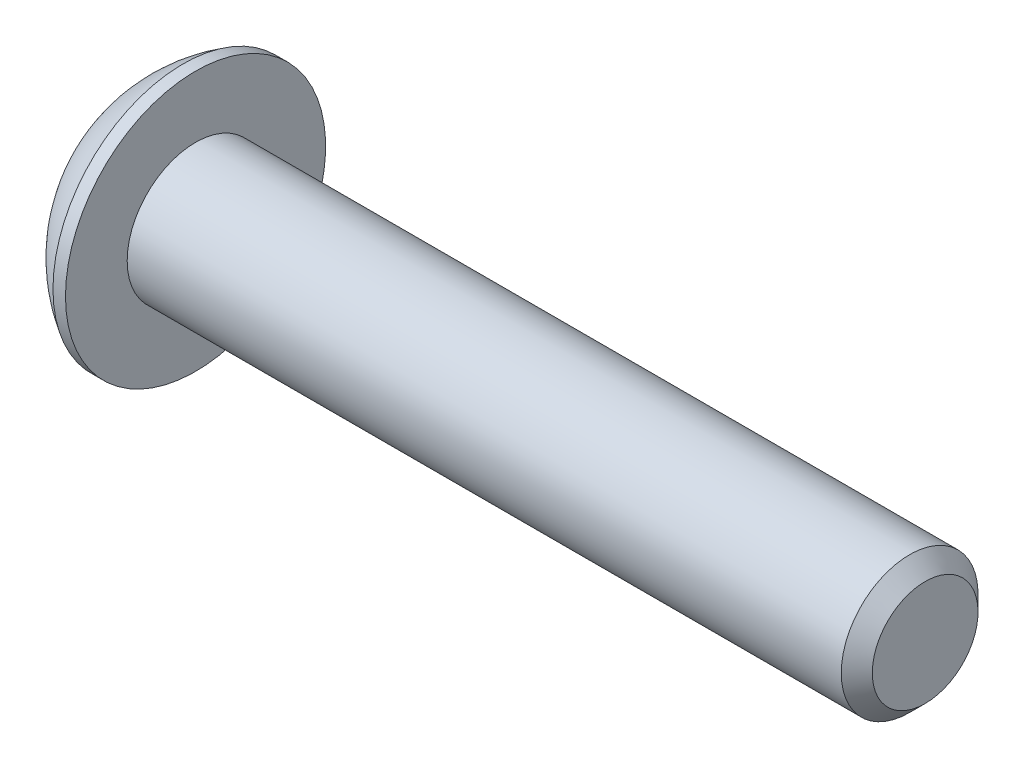
ISO-10303-21;
HEADER;
FILE_DESCRIPTION(('STEP AP214'),'2;1');
FILE_NAME('part.step','',(''),(''),'','','');
FILE_SCHEMA(('AUTOMOTIVE_DESIGN { 1 0 10303 214 1 1 1 1 }'));
ENDSEC;
DATA;
#1=APPLICATION_CONTEXT('core data for automotive mechanical design processes');
#2=APPLICATION_PROTOCOL_DEFINITION('international standard','automotive_design',2000,#1);
#3=PRODUCT_CONTEXT('',#1,'mechanical');
#4=PRODUCT('Part','Part','',(#3));
#5=PRODUCT_RELATED_PRODUCT_CATEGORY('part','',(#4));
#6=PRODUCT_DEFINITION_FORMATION('','',#4);
#7=PRODUCT_DEFINITION_CONTEXT('part definition',#1,'design');
#8=PRODUCT_DEFINITION('design','',#6,#7);
#9=PRODUCT_DEFINITION_SHAPE('','',#8);
#10=(LENGTH_UNIT() NAMED_UNIT(*) SI_UNIT(.MILLI.,.METRE.));
#11=(NAMED_UNIT(*) PLANE_ANGLE_UNIT() SI_UNIT($,.RADIAN.));
#12=(NAMED_UNIT(*) SI_UNIT($,.STERADIAN.) SOLID_ANGLE_UNIT());
#13=UNCERTAINTY_MEASURE_WITH_UNIT(LENGTH_MEASURE(1.E-05),#10,'distance_accuracy_value','');
#14=(GEOMETRIC_REPRESENTATION_CONTEXT(3) GLOBAL_UNCERTAINTY_ASSIGNED_CONTEXT((#13)) GLOBAL_UNIT_ASSIGNED_CONTEXT((#10,
#11,#12)) REPRESENTATION_CONTEXT('',''));
#15=CARTESIAN_POINT('',(0.,0.,0.));
#16=DIRECTION('',(0.,0.,1.));
#17=DIRECTION('',(1.,0.,0.));
#18=AXIS2_PLACEMENT_3D('',#15,#16,#17);
#19=CARTESIAN_POINT('',(1.32080000003043,0.,0.));
#20=DIRECTION('',(-1.,0.,0.));
#21=DIRECTION('',(0.,0.,1.));
#22=AXIS2_PLACEMENT_3D('',#19,#20,#21);
#23=CONICAL_SURFACE('',#22,1.19380000001001,1.04719755096072);
#24=CARTESIAN_POINT('',(2.01004075177025,0.,0.));
#25=VERTEX_POINT('',#24);
#26=VERTEX_LOOP('',#25);
#27=FACE_BOUND('',#26,.T.);
#28=CARTESIAN_POINT('',(1.32080000003043,0.,0.));
#29=DIRECTION('',(-1.,0.,0.));
#30=DIRECTION('',(0.,0.,1.));
#31=AXIS2_PLACEMENT_3D('',#28,#29,#30);
#32=CIRCLE('',#31,1.19380000001001);
#33=CARTESIAN_POINT('',(1.32080000004026,1.03386112704983,-0.596899999979029));
#34=VERTEX_POINT('',#33);
#35=CARTESIAN_POINT('',(1.32080000003062,0.,-1.1938000000025));
#36=VERTEX_POINT('',#35);
#37=EDGE_CURVE('E88',#34,#36,#32,.T.);
#38=ORIENTED_EDGE('',*,*,#37,.T.);
#39=CARTESIAN_POINT('',(1.32080000003043,0.,0.));
#40=DIRECTION('',(-1.,0.,0.));
#41=DIRECTION('',(0.,0.,1.));
#42=AXIS2_PLACEMENT_3D('',#39,#40,#41);
#43=CIRCLE('',#42,1.19380000001001);
#44=CARTESIAN_POINT('',(1.32080000004026,-1.03386112702596,-0.596900000020534));
#45=VERTEX_POINT('',#44);
#46=EDGE_CURVE('E21',#36,#45,#43,.T.);
#47=ORIENTED_EDGE('',*,*,#46,.T.);
#48=CARTESIAN_POINT('',(1.32080000003043,0.,0.));
#49=DIRECTION('',(-1.,0.,0.));
#50=DIRECTION('',(0.,0.,1.));
#51=AXIS2_PLACEMENT_3D('',#48,#49,#50);
#52=CIRCLE('',#51,1.19380000001001);
#53=CARTESIAN_POINT('',(1.32080000004026,-1.03386112704983,0.596899999979029));
#54=VERTEX_POINT('',#53);
#55=EDGE_CURVE('E93',#45,#54,#52,.T.);
#56=ORIENTED_EDGE('',*,*,#55,.T.);
#57=CARTESIAN_POINT('',(1.32080000003043,0.,0.));
#58=DIRECTION('',(-1.,0.,0.));
#59=DIRECTION('',(0.,0.,1.));
#60=AXIS2_PLACEMENT_3D('',#57,#58,#59);
#61=CIRCLE('',#60,1.19380000001001);
#62=CARTESIAN_POINT('',(1.32080000003062,0.,1.1938000000025));
#63=VERTEX_POINT('',#62);
#64=EDGE_CURVE('E105',#54,#63,#61,.T.);
#65=ORIENTED_EDGE('',*,*,#64,.T.);
#66=CARTESIAN_POINT('',(1.32080000003043,0.,0.));
#67=DIRECTION('',(-1.,0.,0.));
#68=DIRECTION('',(0.,0.,1.));
#69=AXIS2_PLACEMENT_3D('',#66,#67,#68);
#70=CIRCLE('',#69,1.19380000001001);
#71=CARTESIAN_POINT('',(1.32080000004026,1.03386112702596,0.596900000020534));
#72=VERTEX_POINT('',#71);
#73=EDGE_CURVE('E113',#63,#72,#70,.T.);
#74=ORIENTED_EDGE('',*,*,#73,.T.);
#75=CARTESIAN_POINT('',(1.32080000003043,0.,0.));
#76=DIRECTION('',(-1.,0.,0.));
#77=DIRECTION('',(0.,0.,1.));
#78=AXIS2_PLACEMENT_3D('',#75,#76,#77);
#79=CIRCLE('',#78,1.19380000001001);
#80=EDGE_CURVE('E215',#72,#34,#79,.T.);
#81=ORIENTED_EDGE('',*,*,#80,.T.);
#82=EDGE_LOOP('',(#38,#47,#56,#65,#74,#81));
#83=FACE_BOUND('',#82,.T.);
#84=ADVANCED_FACE('F17',(#27,#83),#23,.F.);
#85=CARTESIAN_POINT('',(1.3208,-2.06772225407605,-1.1938));
#86=DIRECTION('',(1.,0.,0.));
#87=DIRECTION('',(0.,0.,-1.));
#88=AXIS2_PLACEMENT_3D('',#85,#86,#87);
#89=PLANE('',#88);
#90=ORIENTED_EDGE('',*,*,#46,.F.);
#91=DIRECTION('',(0.,1.,0.));
#92=VECTOR('',#91,1.);
#93=CARTESIAN_POINT('',(1.32080000001016,0.689240751358514,-1.1938));
#94=LINE('',#93,#92);
#95=CARTESIAN_POINT('',(1.32080000002177,-0.689240751358514,-1.1938));
#96=VERTEX_POINT('',#95);
#97=EDGE_CURVE('E100',#96,#36,#94,.T.);
#98=ORIENTED_EDGE('',*,*,#97,.F.);
#99=DIRECTION('',(0.,-0.500000000000017,0.866025403784429));
#100=VECTOR('',#99,1.);
#101=CARTESIAN_POINT('',(1.32080000005008,-0.689240751358514,-1.1938));
#102=LINE('',#101,#100);
#103=EDGE_CURVE('E98',#45,#96,#102,.F.);
#104=ORIENTED_EDGE('',*,*,#103,.F.);
#105=EDGE_LOOP('',(#90,#98,#104));
#106=FACE_BOUND('',#105,.T.);
#107=ADVANCED_FACE('F99',(#106),#89,.F.);
#108=CARTESIAN_POINT('',(1.3208,-2.06772225407605,-1.1938));
#109=DIRECTION('',(1.,0.,0.));
#110=DIRECTION('',(0.,0.,-1.));
#111=AXIS2_PLACEMENT_3D('',#108,#109,#110);
#112=PLANE('',#111);
#113=ORIENTED_EDGE('',*,*,#37,.F.);
#114=DIRECTION('',(0.,-0.500000000000017,-0.866025403784429));
#115=VECTOR('',#114,1.);
#116=CARTESIAN_POINT('',(1.3208000000061,1.37848150271703,0.));
#117=LINE('',#116,#115);
#118=CARTESIAN_POINT('',(1.32080000001669,0.689240751357842,-1.19380000000081));
#119=VERTEX_POINT('',#118);
#120=EDGE_CURVE('E143',#119,#34,#117,.F.);
#121=ORIENTED_EDGE('',*,*,#120,.F.);
#122=DIRECTION('',(0.,1.,0.));
#123=VECTOR('',#122,1.);
#124=CARTESIAN_POINT('',(1.32080000004094,0.689240751358514,-1.1938));
#125=LINE('',#124,#123);
#126=EDGE_CURVE('E119',#36,#119,#125,.T.);
#127=ORIENTED_EDGE('',*,*,#126,.F.);
#128=EDGE_LOOP('',(#113,#121,#127));
#129=FACE_BOUND('',#128,.T.);
#130=ADVANCED_FACE('F226',(#129),#112,.F.);
#131=CARTESIAN_POINT('',(1.3208,-2.06772225407605,-1.1938));
#132=DIRECTION('',(1.,0.,0.));
#133=DIRECTION('',(0.,0.,-1.));
#134=AXIS2_PLACEMENT_3D('',#131,#132,#133);
#135=PLANE('',#134);
#136=ORIENTED_EDGE('',*,*,#80,.F.);
#137=DIRECTION('',(0.,0.500000000000017,-0.866025403784429));
#138=VECTOR('',#137,1.);
#139=CARTESIAN_POINT('',(1.32080000001016,0.689240751358514,1.1938));
#140=LINE('',#139,#138);
#141=CARTESIAN_POINT('',(1.32080000002177,1.37848150271708,0.));
#142=VERTEX_POINT('',#141);
#143=EDGE_CURVE('E153',#142,#72,#140,.F.);
#144=ORIENTED_EDGE('',*,*,#143,.F.);
#145=DIRECTION('',(0.,-0.500000000000017,-0.866025403784429));
#146=VECTOR('',#145,1.);
#147=CARTESIAN_POINT('',(1.32080000005008,1.37848150271703,0.));
#148=LINE('',#147,#146);
#149=EDGE_CURVE('E162',#34,#142,#148,.F.);
#150=ORIENTED_EDGE('',*,*,#149,.F.);
#151=EDGE_LOOP('',(#136,#144,#150));
#152=FACE_BOUND('',#151,.T.);
#153=ADVANCED_FACE('F222',(#152),#135,.F.);
#154=CARTESIAN_POINT('',(1.3208,-2.06772225407605,-1.1938));
#155=DIRECTION('',(1.,0.,0.));
#156=DIRECTION('',(0.,0.,-1.));
#157=AXIS2_PLACEMENT_3D('',#154,#155,#156);
#158=PLANE('',#157);
#159=ORIENTED_EDGE('',*,*,#73,.F.);
#160=DIRECTION('',(0.,1.,0.));
#161=VECTOR('',#160,1.);
#162=CARTESIAN_POINT('',(1.32080000001016,-0.689240751358514,1.1938));
#163=LINE('',#162,#161);
#164=CARTESIAN_POINT('',(1.32080000002177,0.689240751358514,1.1938));
#165=VERTEX_POINT('',#164);
#166=EDGE_CURVE('E129',#165,#63,#163,.F.);
#167=ORIENTED_EDGE('',*,*,#166,.F.);
#168=DIRECTION('',(0.,0.500000000000017,-0.866025403784429));
#169=VECTOR('',#168,1.);
#170=CARTESIAN_POINT('',(1.32080000005008,0.689240751358514,1.1938));
#171=LINE('',#170,#169);
#172=EDGE_CURVE('E140',#72,#165,#171,.F.);
#173=ORIENTED_EDGE('',*,*,#172,.F.);
#174=EDGE_LOOP('',(#159,#167,#173));
#175=FACE_BOUND('',#174,.T.);
#176=ADVANCED_FACE('F376',(#175),#158,.F.);
#177=CARTESIAN_POINT('',(1.3208,-2.06772225407605,-1.1938));
#178=DIRECTION('',(1.,0.,0.));
#179=DIRECTION('',(0.,0.,-1.));
#180=AXIS2_PLACEMENT_3D('',#177,#178,#179);
#181=PLANE('',#180);
#182=ORIENTED_EDGE('',*,*,#55,.F.);
#183=DIRECTION('',(0.,-0.500000000000017,0.866025403784429));
#184=VECTOR('',#183,1.);
#185=CARTESIAN_POINT('',(1.32080000001016,-0.689240751358514,-1.1938));
#186=LINE('',#185,#184);
#187=CARTESIAN_POINT('',(1.32080000002843,-1.37848150271706,0.));
#188=VERTEX_POINT('',#187);
#189=EDGE_CURVE('E104',#188,#45,#186,.F.);
#190=ORIENTED_EDGE('',*,*,#189,.F.);
#191=DIRECTION('',(0.,0.500000000000017,0.866025403784429));
#192=VECTOR('',#191,1.);
#193=CARTESIAN_POINT('',(1.32080000005008,-1.37848150271703,0.));
#194=LINE('',#193,#192);
#195=EDGE_CURVE('E111',#54,#188,#194,.F.);
#196=ORIENTED_EDGE('',*,*,#195,.F.);
#197=EDGE_LOOP('',(#182,#190,#196));
#198=FACE_BOUND('',#197,.T.);
#199=ADVANCED_FACE('F108',(#198),#181,.F.);
#200=CARTESIAN_POINT('',(1.3208,-2.06772225407605,-1.1938));
#201=DIRECTION('',(1.,0.,0.));
#202=DIRECTION('',(0.,0.,-1.));
#203=AXIS2_PLACEMENT_3D('',#200,#201,#202);
#204=PLANE('',#203);
#205=ORIENTED_EDGE('',*,*,#64,.F.);
#206=DIRECTION('',(0.,0.500000000000017,0.866025403784429));
#207=VECTOR('',#206,1.);
#208=CARTESIAN_POINT('',(1.32080000000406,-1.37848150271703,0.));
#209=LINE('',#208,#207);
#210=CARTESIAN_POINT('',(1.32080000001568,-0.689240751357968,1.19380000000081));
#211=VERTEX_POINT('',#210);
#212=EDGE_CURVE('E197',#211,#54,#209,.F.);
#213=ORIENTED_EDGE('',*,*,#212,.F.);
#214=DIRECTION('',(0.,1.,0.));
#215=VECTOR('',#214,1.);
#216=CARTESIAN_POINT('',(1.32080000004094,-0.689240751358514,1.1938));
#217=LINE('',#216,#215);
#218=EDGE_CURVE('E137',#63,#211,#217,.F.);
#219=ORIENTED_EDGE('',*,*,#218,.F.);
#220=EDGE_LOOP('',(#205,#213,#219));
#221=FACE_BOUND('',#220,.T.);
#222=ADVANCED_FACE('F362',(#221),#204,.F.);
#223=CARTESIAN_POINT('',(1.3208,-0.689240751358514,-1.1938));
#224=DIRECTION('',(0.,0.866025403784429,0.500000000000017));
#225=DIRECTION('',(0.,-0.500000000000017,0.866025403784429));
#226=AXIS2_PLACEMENT_3D('',#223,#224,#225);
#227=PLANE('',#226);
#228=DIRECTION('',(1.,0.,0.));
#229=VECTOR('',#228,1.);
#230=CARTESIAN_POINT('',(1.3208,-1.37848150271705,0.));
#231=LINE('',#230,#229);
#232=CARTESIAN_POINT('',(0.,-1.37848150271708,0.));
#233=VERTEX_POINT('',#232);
#234=EDGE_CURVE('E118',#188,#233,#231,.F.);
#235=ORIENTED_EDGE('',*,*,#234,.F.);
#236=ORIENTED_EDGE('',*,*,#189,.T.);
#237=ORIENTED_EDGE('',*,*,#103,.T.);
#238=DIRECTION('',(1.,0.,0.));
#239=VECTOR('',#238,1.);
#240=CARTESIAN_POINT('',(1.3208,-0.689240751358514,-1.1938));
#241=LINE('',#240,#239);
#242=CARTESIAN_POINT('',(0.,-0.689240751358514,-1.1938));
#243=VERTEX_POINT('',#242);
#244=EDGE_CURVE('E121',#243,#96,#241,.T.);
#245=ORIENTED_EDGE('',*,*,#244,.F.);
#246=DIRECTION('',(0.,0.499999999999992,-0.866025403784443));
#247=VECTOR('',#246,1.);
#248=CARTESIAN_POINT('',(0.,-1.37848150271706,0.));
#249=LINE('',#248,#247);
#250=EDGE_CURVE('E184',#233,#243,#249,.T.);
#251=ORIENTED_EDGE('',*,*,#250,.F.);
#252=EDGE_LOOP('',(#235,#236,#237,#245,#251));
#253=FACE_BOUND('',#252,.T.);
#254=ADVANCED_FACE('F115',(#253),#227,.T.);
#255=CARTESIAN_POINT('',(1.3208,0.689240751358514,-1.1938));
#256=DIRECTION('',(0.,0.,1.));
#257=DIRECTION('',(1.,0.,0.));
#258=AXIS2_PLACEMENT_3D('',#255,#256,#257);
#259=PLANE('',#258);
#260=ORIENTED_EDGE('',*,*,#244,.T.);
#261=ORIENTED_EDGE('',*,*,#97,.T.);
#262=ORIENTED_EDGE('',*,*,#126,.T.);
#263=DIRECTION('',(1.,0.,0.));
#264=VECTOR('',#263,1.);
#265=CARTESIAN_POINT('',(1.3208,0.689240751358445,-1.19379999999996));
#266=LINE('',#265,#264);
#267=CARTESIAN_POINT('',(0.,0.689240751358434,-1.19380000000002));
#268=VERTEX_POINT('',#267);
#269=EDGE_CURVE('E164',#268,#119,#266,.T.);
#270=ORIENTED_EDGE('',*,*,#269,.F.);
#271=DIRECTION('',(0.,1.,0.));
#272=VECTOR('',#271,1.);
#273=CARTESIAN_POINT('',(0.,0.,-1.1938));
#274=LINE('',#273,#272);
#275=EDGE_CURVE('E169',#243,#268,#274,.T.);
#276=ORIENTED_EDGE('',*,*,#275,.F.);
#277=EDGE_LOOP('',(#260,#261,#262,#270,#276));
#278=FACE_BOUND('',#277,.T.);
#279=ADVANCED_FACE('F231',(#278),#259,.T.);
#280=CARTESIAN_POINT('',(1.3208,1.37848150271703,0.));
#281=DIRECTION('',(0.,-0.866025403784429,0.500000000000017));
#282=DIRECTION('',(0.,-0.500000000000017,-0.866025403784429));
#283=AXIS2_PLACEMENT_3D('',#280,#281,#282);
#284=PLANE('',#283);
#285=ORIENTED_EDGE('',*,*,#269,.T.);
#286=ORIENTED_EDGE('',*,*,#120,.T.);
#287=ORIENTED_EDGE('',*,*,#149,.T.);
#288=DIRECTION('',(1.,0.,0.));
#289=VECTOR('',#288,1.);
#290=CARTESIAN_POINT('',(1.3208,1.3784815027171,0.));
#291=LINE('',#290,#289);
#292=CARTESIAN_POINT('',(0.,1.37848150271708,0.));
#293=VERTEX_POINT('',#292);
#294=EDGE_CURVE('E142',#293,#142,#291,.T.);
#295=ORIENTED_EDGE('',*,*,#294,.F.);
#296=DIRECTION('',(0.,0.500000000000004,0.866025403784436));
#297=VECTOR('',#296,1.);
#298=CARTESIAN_POINT('',(0.,0.689240751358479,-1.19379999999998));
#299=LINE('',#298,#297);
#300=EDGE_CURVE('E150',#268,#293,#299,.T.);
#301=ORIENTED_EDGE('',*,*,#300,.F.);
#302=EDGE_LOOP('',(#285,#286,#287,#295,#301));
#303=FACE_BOUND('',#302,.T.);
#304=ADVANCED_FACE('F227',(#303),#284,.T.);
#305=CARTESIAN_POINT('',(1.3208,0.689240751358514,1.1938));
#306=DIRECTION('',(0.,-0.866025403784429,-0.500000000000017));
#307=DIRECTION('',(0.,0.500000000000017,-0.866025403784429));
#308=AXIS2_PLACEMENT_3D('',#305,#306,#307);
#309=PLANE('',#308);
#310=ORIENTED_EDGE('',*,*,#294,.T.);
#311=ORIENTED_EDGE('',*,*,#143,.T.);
#312=ORIENTED_EDGE('',*,*,#172,.T.);
#313=DIRECTION('',(-1.,0.,0.));
#314=VECTOR('',#313,1.);
#315=CARTESIAN_POINT('',(1.3208,0.689240751358514,1.1938));
#316=LINE('',#315,#314);
#317=CARTESIAN_POINT('',(0.,0.689240751358514,1.1938));
#318=VERTEX_POINT('',#317);
#319=EDGE_CURVE('E132',#318,#165,#316,.F.);
#320=ORIENTED_EDGE('',*,*,#319,.F.);
#321=DIRECTION('',(0.,-0.499999999999992,0.866025403784443));
#322=VECTOR('',#321,1.);
#323=CARTESIAN_POINT('',(0.,1.37848150271706,0.));
#324=LINE('',#323,#322);
#325=EDGE_CURVE('E146',#293,#318,#324,.T.);
#326=ORIENTED_EDGE('',*,*,#325,.F.);
#327=EDGE_LOOP('',(#310,#311,#312,#320,#326));
#328=FACE_BOUND('',#327,.T.);
#329=ADVANCED_FACE('F336',(#328),#309,.T.);
#330=CARTESIAN_POINT('',(1.3208,-0.689240751358514,1.1938));
#331=DIRECTION('',(0.,0.,-1.));
#332=DIRECTION('',(-1.,0.,0.));
#333=AXIS2_PLACEMENT_3D('',#330,#331,#332);
#334=PLANE('',#333);
#335=ORIENTED_EDGE('',*,*,#319,.T.);
#336=ORIENTED_EDGE('',*,*,#166,.T.);
#337=ORIENTED_EDGE('',*,*,#218,.T.);
#338=DIRECTION('',(1.,0.,0.));
#339=VECTOR('',#338,1.);
#340=CARTESIAN_POINT('',(1.3208,-0.689240751358445,1.19379999999996));
#341=LINE('',#340,#339);
#342=CARTESIAN_POINT('',(0.,-0.689240751358445,1.19379999999996));
#343=VERTEX_POINT('',#342);
#344=EDGE_CURVE('E36',#343,#211,#341,.T.);
#345=ORIENTED_EDGE('',*,*,#344,.F.);
#346=DIRECTION('',(0.,1.,0.));
#347=VECTOR('',#346,1.);
#348=CARTESIAN_POINT('',(0.,0.,1.1938));
#349=LINE('',#348,#347);
#350=EDGE_CURVE('E149',#318,#343,#349,.F.);
#351=ORIENTED_EDGE('',*,*,#350,.F.);
#352=EDGE_LOOP('',(#335,#336,#337,#345,#351));
#353=FACE_BOUND('',#352,.T.);
#354=ADVANCED_FACE('F329',(#353),#334,.T.);
#355=CARTESIAN_POINT('',(1.3208,-1.37848150271703,0.));
#356=DIRECTION('',(0.,0.866025403784429,-0.500000000000017));
#357=DIRECTION('',(0.,0.500000000000017,0.866025403784429));
#358=AXIS2_PLACEMENT_3D('',#355,#356,#357);
#359=PLANE('',#358);
#360=ORIENTED_EDGE('',*,*,#344,.T.);
#361=ORIENTED_EDGE('',*,*,#212,.T.);
#362=ORIENTED_EDGE('',*,*,#195,.T.);
#363=ORIENTED_EDGE('',*,*,#234,.T.);
#364=DIRECTION('',(0.,-0.500000000000004,-0.866025403784436));
#365=VECTOR('',#364,1.);
#366=CARTESIAN_POINT('',(0.,-0.689240751358479,1.19379999999998));
#367=LINE('',#366,#365);
#368=EDGE_CURVE('E212',#343,#233,#367,.T.);
#369=ORIENTED_EDGE('',*,*,#368,.F.);
#370=EDGE_LOOP('',(#360,#361,#362,#363,#369));
#371=FACE_BOUND('',#370,.T.);
#372=ADVANCED_FACE('F235',(#371),#359,.T.);
#373=CARTESIAN_POINT('',(0.,0.,0.));
#374=DIRECTION('',(-1.,0.,0.));
#375=DIRECTION('',(0.,0.,1.));
#376=AXIS2_PLACEMENT_3D('',#373,#374,#375);
#377=PLANE('',#376);
#378=CARTESIAN_POINT('',(0.,0.,0.));
#379=DIRECTION('',(-1.,0.,0.));
#380=DIRECTION('',(0.,0.,1.));
#381=AXIS2_PLACEMENT_3D('',#378,#379,#380);
#382=CIRCLE('',#381,1.98120000000012);
#383=CARTESIAN_POINT('',(0.,0.,1.98120000000012));
#384=VERTEX_POINT('',#383);
#385=EDGE_CURVE('E209',#384,#384,#382,.F.);
#386=ORIENTED_EDGE('',*,*,#385,.F.);
#387=EDGE_LOOP('',(#386));
#388=FACE_BOUND('',#387,.T.);
#389=ORIENTED_EDGE('',*,*,#350,.T.);
#390=ORIENTED_EDGE('',*,*,#368,.T.);
#391=ORIENTED_EDGE('',*,*,#250,.T.);
#392=ORIENTED_EDGE('',*,*,#275,.T.);
#393=ORIENTED_EDGE('',*,*,#300,.T.);
#394=ORIENTED_EDGE('',*,*,#325,.T.);
#395=EDGE_LOOP('',(#389,#390,#391,#392,#393,#394));
#396=FACE_BOUND('',#395,.T.);
#397=ADVANCED_FACE('F238',(#388,#396),#377,.T.);
#398=CARTESIAN_POINT('',(4.13385,0.,0.));
#399=DIRECTION('',(-0.0817796561711032,-0.995591648055329,0.0459277493353513));
#400=DIRECTION('',(-0.482878541003222,0.0798924523578751,0.872035269180579));
#401=AXIS2_PLACEMENT_3D('',#398,#399,#400);
#402=SPHERICAL_SURFACE('',#401,4.58408870578444);
#403=CARTESIAN_POINT('',(4.13385,0.,0.));
#404=DIRECTION('',(-1.,0.,0.));
#405=DIRECTION('',(0.,0.,1.));
#406=AXIS2_PLACEMENT_3D('',#403,#404,#405);
#407=SPHERICAL_SURFACE('',#406,4.58408870578444);
#408=CARTESIAN_POINT('',(1.8287999999999,0.,0.));
#409=DIRECTION('',(-1.,0.,0.));
#410=DIRECTION('',(0.,0.,1.));
#411=AXIS2_PLACEMENT_3D('',#408,#409,#410);
#412=CIRCLE('',#411,3.9624);
#413=CARTESIAN_POINT('',(1.8287999999999,0.,3.9624));
#414=VERTEX_POINT('',#413);
#415=EDGE_CURVE('E206',#414,#414,#412,.F.);
#416=ORIENTED_EDGE('',*,*,#415,.F.);
#417=EDGE_LOOP('',(#416));
#418=FACE_BOUND('',#417,.T.);
#419=ORIENTED_EDGE('',*,*,#385,.T.);
#420=EDGE_LOOP('',(#419));
#421=FACE_BOUND('',#420,.T.);
#422=ADVANCED_FACE('F19',(#418,#421),#407,.T.);
#423=CARTESIAN_POINT('',(24.4348,0.,0.));
#424=DIRECTION('',(-1.,0.,0.));
#425=DIRECTION('',(0.,0.,1.));
#426=AXIS2_PLACEMENT_3D('',#423,#424,#425);
#427=PLANE('',#426);
#428=CARTESIAN_POINT('',(24.4347999999945,0.,0.));
#429=DIRECTION('',(-1.,0.,0.));
#430=DIRECTION('',(0.,-1.,0.));
#431=AXIS2_PLACEMENT_3D('',#428,#429,#430);
#432=CIRCLE('',#431,1.61035999991554);
#433=CARTESIAN_POINT('',(24.4347999999945,-1.61035999991554,0.));
#434=VERTEX_POINT('',#433);
#435=EDGE_CURVE('E203',#434,#434,#432,.T.);
#436=ORIENTED_EDGE('',*,*,#435,.F.);
#437=EDGE_LOOP('',(#436));
#438=FACE_BOUND('',#437,.T.);
#439=ADVANCED_FACE('F271',(#438),#427,.F.);
#440=CARTESIAN_POINT('',(0.,0.,0.));
#441=DIRECTION('',(-1.,0.,0.));
#442=DIRECTION('',(0.,0.,1.));
#443=AXIS2_PLACEMENT_3D('',#440,#441,#442);
#444=CYLINDRICAL_SURFACE('',#443,3.9624);
#445=ORIENTED_EDGE('',*,*,#415,.T.);
#446=EDGE_LOOP('',(#445));
#447=FACE_BOUND('',#446,.T.);
#448=CARTESIAN_POINT('',(2.2098,0.,0.));
#449=DIRECTION('',(-1.,0.,0.));
#450=DIRECTION('',(0.,0.,1.));
#451=AXIS2_PLACEMENT_3D('',#448,#449,#450);
#452=CIRCLE('',#451,3.9624);
#453=CARTESIAN_POINT('',(2.2098,0.,3.9624));
#454=VERTEX_POINT('',#453);
#455=EDGE_CURVE('E200',#454,#454,#452,.T.);
#456=ORIENTED_EDGE('',*,*,#455,.T.);
#457=EDGE_LOOP('',(#456));
#458=FACE_BOUND('',#457,.T.);
#459=ADVANCED_FACE('F267',(#447,#458),#444,.T.);
#460=CARTESIAN_POINT('',(23.9623600000414,0.,0.));
#461=DIRECTION('',(-1.,0.,0.));
#462=DIRECTION('',(0.,-1.,0.));
#463=AXIS2_PLACEMENT_3D('',#460,#461,#462);
#464=CONICAL_SURFACE('',#463,2.08279999986871,0.785398163397448);
#465=CARTESIAN_POINT('',(23.9623599999492,0.,0.));
#466=DIRECTION('',(-1.,0.,0.));
#467=DIRECTION('',(0.,0.,1.));
#468=AXIS2_PLACEMENT_3D('',#465,#466,#467);
#469=CIRCLE('',#468,2.0828);
#470=CARTESIAN_POINT('',(23.9623599999492,0.,2.0828));
#471=VERTEX_POINT('',#470);
#472=EDGE_CURVE('E27',#471,#471,#469,.T.);
#473=ORIENTED_EDGE('',*,*,#472,.F.);
#474=EDGE_LOOP('',(#473));
#475=FACE_BOUND('',#474,.T.);
#476=ORIENTED_EDGE('',*,*,#435,.T.);
#477=EDGE_LOOP('',(#476));
#478=FACE_BOUND('',#477,.T.);
#479=ADVANCED_FACE('F263',(#475,#478),#464,.T.);
#480=CARTESIAN_POINT('',(2.2098,2.0828,0.));
#481=DIRECTION('',(-1.,0.,0.));
#482=DIRECTION('',(0.,0.,1.));
#483=AXIS2_PLACEMENT_3D('',#480,#481,#482);
#484=PLANE('',#483);
#485=ORIENTED_EDGE('',*,*,#455,.F.);
#486=EDGE_LOOP('',(#485));
#487=FACE_BOUND('',#486,.T.);
#488=CARTESIAN_POINT('',(2.2098,0.,0.));
#489=DIRECTION('',(-1.,0.,0.));
#490=DIRECTION('',(0.,0.,1.));
#491=AXIS2_PLACEMENT_3D('',#488,#489,#490);
#492=CIRCLE('',#491,2.0828);
#493=CARTESIAN_POINT('',(2.2098,0.,2.0828));
#494=VERTEX_POINT('',#493);
#495=EDGE_CURVE('E11',#494,#494,#492,.F.);
#496=ORIENTED_EDGE('',*,*,#495,.F.);
#497=EDGE_LOOP('',(#496));
#498=FACE_BOUND('',#497,.T.);
#499=ADVANCED_FACE('F266',(#487,#498),#484,.F.);
#500=CARTESIAN_POINT('',(0.,0.,0.));
#501=DIRECTION('',(-1.,0.,0.));
#502=DIRECTION('',(0.,0.,1.));
#503=AXIS2_PLACEMENT_3D('',#500,#501,#502);
#504=CYLINDRICAL_SURFACE('',#503,2.0828);
#505=ORIENTED_EDGE('',*,*,#495,.T.);
#506=EDGE_LOOP('',(#505));
#507=FACE_BOUND('',#506,.T.);
#508=ORIENTED_EDGE('',*,*,#472,.T.);
#509=EDGE_LOOP('',(#508));
#510=FACE_BOUND('',#509,.T.);
#511=ADVANCED_FACE('F261',(#507,#510),#504,.T.);
#512=CLOSED_SHELL('',(#84,#107,#130,#153,#176,#199,#222,#254,#279,#304,#329,#354,#372,#397,#422,
#439,#459,#479,#499,#511));
#513=MANIFOLD_SOLID_BREP('B1',#512);
#514=ADVANCED_BREP_SHAPE_REPRESENTATION('',(#18,#513),#14);
#515=SHAPE_DEFINITION_REPRESENTATION(#9,#514);
ENDSEC;
END-ISO-10303-21;
